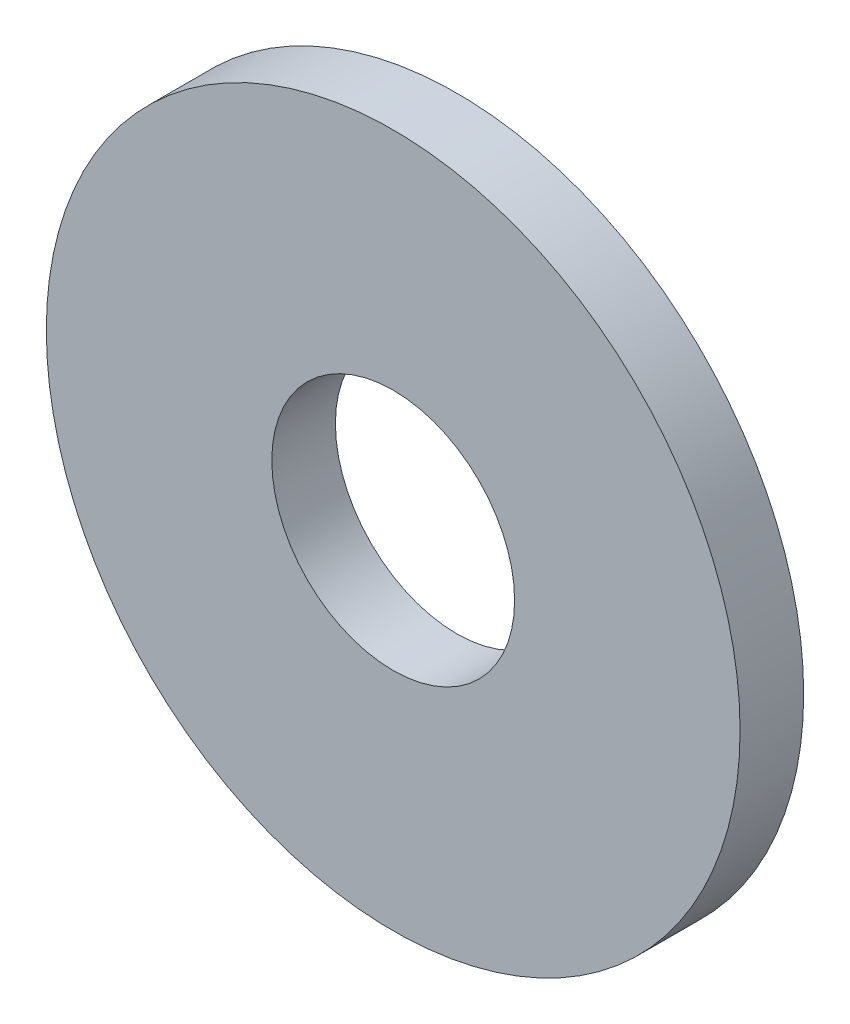
ISO-10303-21;
HEADER;
FILE_DESCRIPTION(('STEP AP214'),'2;1');
FILE_NAME('part.step','',(''),(''),'','','');
FILE_SCHEMA(('AUTOMOTIVE_DESIGN { 1 0 10303 214 1 1 1 1 }'));
ENDSEC;
DATA;
#1=APPLICATION_CONTEXT('core data for automotive mechanical design processes');
#2=APPLICATION_PROTOCOL_DEFINITION('international standard','automotive_design',2000,#1);
#3=PRODUCT_CONTEXT('',#1,'mechanical');
#4=PRODUCT('Part','Part','',(#3));
#5=PRODUCT_RELATED_PRODUCT_CATEGORY('part','',(#4));
#6=PRODUCT_DEFINITION_FORMATION('','',#4);
#7=PRODUCT_DEFINITION_CONTEXT('part definition',#1,'design');
#8=PRODUCT_DEFINITION('design','',#6,#7);
#9=PRODUCT_DEFINITION_SHAPE('','',#8);
#10=(LENGTH_UNIT() NAMED_UNIT(*) SI_UNIT(.MILLI.,.METRE.));
#11=(NAMED_UNIT(*) PLANE_ANGLE_UNIT() SI_UNIT($,.RADIAN.));
#12=(NAMED_UNIT(*) SI_UNIT($,.STERADIAN.) SOLID_ANGLE_UNIT());
#13=UNCERTAINTY_MEASURE_WITH_UNIT(LENGTH_MEASURE(1.E-05),#10,'distance_accuracy_value','');
#14=(GEOMETRIC_REPRESENTATION_CONTEXT(3) GLOBAL_UNCERTAINTY_ASSIGNED_CONTEXT((#13)) GLOBAL_UNIT_ASSIGNED_CONTEXT((#10,
#11,#12)) REPRESENTATION_CONTEXT('',''));
#15=CARTESIAN_POINT('',(0.,0.,0.));
#16=DIRECTION('',(0.,0.,1.));
#17=DIRECTION('',(1.,0.,0.));
#18=AXIS2_PLACEMENT_3D('',#15,#16,#17);
#19=CARTESIAN_POINT('',(0.,0.,0.));
#20=DIRECTION('',(0.,0.,1.));
#21=DIRECTION('',(1.,0.,0.));
#22=AXIS2_PLACEMENT_3D('',#19,#20,#21);
#23=PLANE('',#22);
#24=CARTESIAN_POINT('',(0.,0.,0.));
#25=DIRECTION('',(0.,0.,-1.));
#26=DIRECTION('',(-1.,0.,0.));
#27=AXIS2_PLACEMENT_3D('',#24,#25,#26);
#28=CIRCLE('',#27,4.2);
#29=CARTESIAN_POINT('',(-4.2,0.,0.));
#30=VERTEX_POINT('',#29);
#31=EDGE_CURVE('E27',#30,#30,#28,.F.);
#32=ORIENTED_EDGE('',*,*,#31,.T.);
#33=EDGE_LOOP('',(#32));
#34=FACE_BOUND('',#33,.T.);
#35=CARTESIAN_POINT('',(0.,0.,0.));
#36=DIRECTION('',(0.,0.,-1.));
#37=DIRECTION('',(-1.,0.,0.));
#38=AXIS2_PLACEMENT_3D('',#35,#36,#37);
#39=CIRCLE('',#38,12.);
#40=CARTESIAN_POINT('',(-12.,0.,0.));
#41=VERTEX_POINT('',#40);
#42=EDGE_CURVE('E18',#41,#41,#39,.F.);
#43=ORIENTED_EDGE('',*,*,#42,.F.);
#44=EDGE_LOOP('',(#43));
#45=FACE_BOUND('',#44,.T.);
#46=ADVANCED_FACE('F15',(#34,#45),#23,.F.);
#47=CARTESIAN_POINT('',(0.,0.,2.2));
#48=DIRECTION('',(0.,0.,-1.));
#49=DIRECTION('',(-1.,0.,0.));
#50=AXIS2_PLACEMENT_3D('',#47,#48,#49);
#51=CYLINDRICAL_SURFACE('',#50,12.);
#52=CARTESIAN_POINT('',(0.,0.,2.2));
#53=DIRECTION('',(0.,0.,-1.));
#54=DIRECTION('',(-1.,0.,0.));
#55=AXIS2_PLACEMENT_3D('',#52,#53,#54);
#56=CIRCLE('',#55,12.);
#57=CARTESIAN_POINT('',(-12.,0.,2.2));
#58=VERTEX_POINT('',#57);
#59=EDGE_CURVE('E22',#58,#58,#56,.F.);
#60=ORIENTED_EDGE('',*,*,#59,.F.);
#61=EDGE_LOOP('',(#60));
#62=FACE_BOUND('',#61,.T.);
#63=ORIENTED_EDGE('',*,*,#42,.T.);
#64=EDGE_LOOP('',(#63));
#65=FACE_BOUND('',#64,.T.);
#66=ADVANCED_FACE('F35',(#62,#65),#51,.T.);
#67=CARTESIAN_POINT('',(0.,0.,2.2));
#68=DIRECTION('',(0.,0.,-1.));
#69=DIRECTION('',(-1.,0.,0.));
#70=AXIS2_PLACEMENT_3D('',#67,#68,#69);
#71=CYLINDRICAL_SURFACE('',#70,4.2);
#72=ORIENTED_EDGE('',*,*,#31,.F.);
#73=EDGE_LOOP('',(#72));
#74=FACE_BOUND('',#73,.T.);
#75=CARTESIAN_POINT('',(0.,0.,2.2));
#76=DIRECTION('',(0.,0.,-1.));
#77=DIRECTION('',(-1.,0.,0.));
#78=AXIS2_PLACEMENT_3D('',#75,#76,#77);
#79=CIRCLE('',#78,4.2);
#80=CARTESIAN_POINT('',(-4.2,0.,2.2));
#81=VERTEX_POINT('',#80);
#82=EDGE_CURVE('E10',#81,#81,#79,.T.);
#83=ORIENTED_EDGE('',*,*,#82,.F.);
#84=EDGE_LOOP('',(#83));
#85=FACE_BOUND('',#84,.T.);
#86=ADVANCED_FACE('F42',(#74,#85),#71,.F.);
#87=CARTESIAN_POINT('',(0.,0.,2.2));
#88=DIRECTION('',(0.,0.,1.));
#89=DIRECTION('',(1.,0.,0.));
#90=AXIS2_PLACEMENT_3D('',#87,#88,#89);
#91=PLANE('',#90);
#92=ORIENTED_EDGE('',*,*,#82,.T.);
#93=EDGE_LOOP('',(#92));
#94=FACE_BOUND('',#93,.T.);
#95=ORIENTED_EDGE('',*,*,#59,.T.);
#96=EDGE_LOOP('',(#95));
#97=FACE_BOUND('',#96,.T.);
#98=ADVANCED_FACE('F44',(#94,#97),#91,.T.);
#99=CLOSED_SHELL('',(#46,#66,#86,#98));
#100=MANIFOLD_SOLID_BREP('B1',#99);
#101=ADVANCED_BREP_SHAPE_REPRESENTATION('',(#18,#100),#14);
#102=SHAPE_DEFINITION_REPRESENTATION(#9,#101);
ENDSEC;
END-ISO-10303-21;
